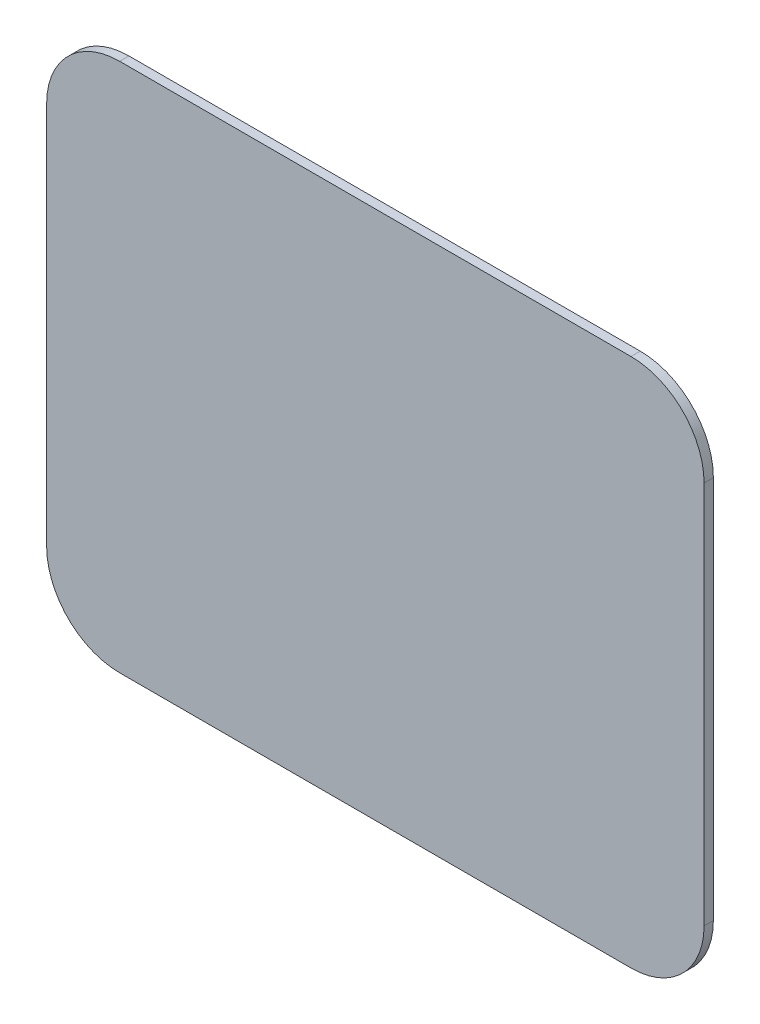
ISO-10303-21;
HEADER;
FILE_DESCRIPTION(('STEP AP214'),'2;1');
FILE_NAME('part.step','',(''),(''),'','','');
FILE_SCHEMA(('AUTOMOTIVE_DESIGN { 1 0 10303 214 1 1 1 1 }'));
ENDSEC;
DATA;
#1=APPLICATION_CONTEXT('core data for automotive mechanical design processes');
#2=APPLICATION_PROTOCOL_DEFINITION('international standard','automotive_design',2000,#1);
#3=PRODUCT_CONTEXT('',#1,'mechanical');
#4=PRODUCT('Part','Part','',(#3));
#5=PRODUCT_RELATED_PRODUCT_CATEGORY('part','',(#4));
#6=PRODUCT_DEFINITION_FORMATION('','',#4);
#7=PRODUCT_DEFINITION_CONTEXT('part definition',#1,'design');
#8=PRODUCT_DEFINITION('design','',#6,#7);
#9=PRODUCT_DEFINITION_SHAPE('','',#8);
#10=(LENGTH_UNIT() NAMED_UNIT(*) SI_UNIT(.MILLI.,.METRE.));
#11=(NAMED_UNIT(*) PLANE_ANGLE_UNIT() SI_UNIT($,.RADIAN.));
#12=(NAMED_UNIT(*) SI_UNIT($,.STERADIAN.) SOLID_ANGLE_UNIT());
#13=UNCERTAINTY_MEASURE_WITH_UNIT(LENGTH_MEASURE(1.E-05),#10,'distance_accuracy_value','');
#14=(GEOMETRIC_REPRESENTATION_CONTEXT(3) GLOBAL_UNCERTAINTY_ASSIGNED_CONTEXT((#13)) GLOBAL_UNIT_ASSIGNED_CONTEXT((#10,
#11,#12)) REPRESENTATION_CONTEXT('',''));
#15=CARTESIAN_POINT('',(0.,0.,0.));
#16=DIRECTION('',(0.,0.,1.));
#17=DIRECTION('',(1.,0.,0.));
#18=AXIS2_PLACEMENT_3D('',#15,#16,#17);
#19=CARTESIAN_POINT('',(-18.,14.5,0.508));
#20=DIRECTION('',(1.,0.,0.));
#21=DIRECTION('',(0.,1.,0.));
#22=AXIS2_PLACEMENT_3D('',#19,#20,#21);
#23=PLANE('',#22);
#24=DIRECTION('',(0.,-1.,0.));
#25=VECTOR('',#24,1.);
#26=CARTESIAN_POINT('',(-18.,14.5,0.));
#27=LINE('',#26,#25);
#28=CARTESIAN_POINT('',(-18.,10.5,0.));
#29=VERTEX_POINT('',#28);
#30=CARTESIAN_POINT('',(-18.,-10.5,0.));
#31=VERTEX_POINT('',#30);
#32=EDGE_CURVE('E131',#29,#31,#27,.T.);
#33=ORIENTED_EDGE('',*,*,#32,.T.);
#34=DIRECTION('',(0.,0.,-1.));
#35=VECTOR('',#34,1.);
#36=CARTESIAN_POINT('',(-18.,-10.5,0.508));
#37=LINE('',#36,#35);
#38=CARTESIAN_POINT('',(-18.,-10.5,0.508));
#39=VERTEX_POINT('',#38);
#40=EDGE_CURVE('E109',#31,#39,#37,.F.);
#41=ORIENTED_EDGE('',*,*,#40,.T.);
#42=DIRECTION('',(0.,-1.,0.));
#43=VECTOR('',#42,1.);
#44=CARTESIAN_POINT('',(-18.,14.5,0.508));
#45=LINE('',#44,#43);
#46=CARTESIAN_POINT('',(-18.,10.5,0.508));
#47=VERTEX_POINT('',#46);
#48=EDGE_CURVE('E140',#47,#39,#45,.T.);
#49=ORIENTED_EDGE('',*,*,#48,.F.);
#50=DIRECTION('',(0.,0.,-1.));
#51=VECTOR('',#50,1.);
#52=CARTESIAN_POINT('',(-18.,10.5,0.508));
#53=LINE('',#52,#51);
#54=EDGE_CURVE('E114',#47,#29,#53,.T.);
#55=ORIENTED_EDGE('',*,*,#54,.T.);
#56=EDGE_LOOP('',(#33,#41,#49,#55));
#57=FACE_BOUND('',#56,.T.);
#58=ADVANCED_FACE('F38',(#57),#23,.F.);
#59=CARTESIAN_POINT('',(-18.,-14.5,0.508));
#60=DIRECTION('',(0.,1.,0.));
#61=DIRECTION('',(0.,0.,1.));
#62=AXIS2_PLACEMENT_3D('',#59,#60,#61);
#63=PLANE('',#62);
#64=DIRECTION('',(1.,0.,0.));
#65=VECTOR('',#64,1.);
#66=CARTESIAN_POINT('',(-18.,-14.5,0.508));
#67=LINE('',#66,#65);
#68=CARTESIAN_POINT('',(-14.,-14.5,0.508));
#69=VERTEX_POINT('',#68);
#70=CARTESIAN_POINT('',(14.,-14.5,0.508));
#71=VERTEX_POINT('',#70);
#72=EDGE_CURVE('E124',#69,#71,#67,.T.);
#73=ORIENTED_EDGE('',*,*,#72,.F.);
#74=DIRECTION('',(0.,0.,-1.));
#75=VECTOR('',#74,1.);
#76=CARTESIAN_POINT('',(-14.,-14.5,0.508));
#77=LINE('',#76,#75);
#78=CARTESIAN_POINT('',(-14.,-14.5,0.));
#79=VERTEX_POINT('',#78);
#80=EDGE_CURVE('E108',#69,#79,#77,.T.);
#81=ORIENTED_EDGE('',*,*,#80,.T.);
#82=DIRECTION('',(1.,0.,0.));
#83=VECTOR('',#82,1.);
#84=CARTESIAN_POINT('',(-18.,-14.5,0.));
#85=LINE('',#84,#83);
#86=CARTESIAN_POINT('',(14.,-14.5,0.));
#87=VERTEX_POINT('',#86);
#88=EDGE_CURVE('E121',#79,#87,#85,.T.);
#89=ORIENTED_EDGE('',*,*,#88,.T.);
#90=DIRECTION('',(0.,0.,-1.));
#91=VECTOR('',#90,1.);
#92=CARTESIAN_POINT('',(14.,-14.5,0.508));
#93=LINE('',#92,#91);
#94=EDGE_CURVE('E126',#87,#71,#93,.F.);
#95=ORIENTED_EDGE('',*,*,#94,.T.);
#96=EDGE_LOOP('',(#73,#81,#89,#95));
#97=FACE_BOUND('',#96,.T.);
#98=ADVANCED_FACE('F120',(#97),#63,.F.);
#99=CARTESIAN_POINT('',(18.,14.5,0.508));
#100=DIRECTION('',(-1.,0.,0.));
#101=DIRECTION('',(0.,-1.,0.));
#102=AXIS2_PLACEMENT_3D('',#99,#100,#101);
#103=PLANE('',#102);
#104=DIRECTION('',(0.,1.,0.));
#105=VECTOR('',#104,1.);
#106=CARTESIAN_POINT('',(18.,14.5,0.508));
#107=LINE('',#106,#105);
#108=CARTESIAN_POINT('',(18.,-10.5,0.508));
#109=VERTEX_POINT('',#108);
#110=CARTESIAN_POINT('',(18.,10.5,0.508));
#111=VERTEX_POINT('',#110);
#112=EDGE_CURVE('E166',#109,#111,#107,.T.);
#113=ORIENTED_EDGE('',*,*,#112,.F.);
#114=DIRECTION('',(0.,0.,-1.));
#115=VECTOR('',#114,1.);
#116=CARTESIAN_POINT('',(18.,-10.5,0.508));
#117=LINE('',#116,#115);
#118=CARTESIAN_POINT('',(18.,-10.5,0.));
#119=VERTEX_POINT('',#118);
#120=EDGE_CURVE('E159',#109,#119,#117,.T.);
#121=ORIENTED_EDGE('',*,*,#120,.T.);
#122=DIRECTION('',(0.,1.,0.));
#123=VECTOR('',#122,1.);
#124=CARTESIAN_POINT('',(18.,14.5,0.));
#125=LINE('',#124,#123);
#126=CARTESIAN_POINT('',(18.,10.5,0.));
#127=VERTEX_POINT('',#126);
#128=EDGE_CURVE('E130',#119,#127,#125,.T.);
#129=ORIENTED_EDGE('',*,*,#128,.T.);
#130=DIRECTION('',(0.,0.,-1.));
#131=VECTOR('',#130,1.);
#132=CARTESIAN_POINT('',(18.,10.5,0.508));
#133=LINE('',#132,#131);
#134=EDGE_CURVE('E157',#127,#111,#133,.F.);
#135=ORIENTED_EDGE('',*,*,#134,.T.);
#136=EDGE_LOOP('',(#113,#121,#129,#135));
#137=FACE_BOUND('',#136,.T.);
#138=ADVANCED_FACE('F164',(#137),#103,.F.);
#139=CARTESIAN_POINT('',(-18.,14.5,0.508));
#140=DIRECTION('',(0.,-1.,0.));
#141=DIRECTION('',(0.,0.,-1.));
#142=AXIS2_PLACEMENT_3D('',#139,#140,#141);
#143=PLANE('',#142);
#144=DIRECTION('',(-1.,0.,0.));
#145=VECTOR('',#144,1.);
#146=CARTESIAN_POINT('',(-18.,14.5,0.508));
#147=LINE('',#146,#145);
#148=CARTESIAN_POINT('',(14.,14.5,0.508));
#149=VERTEX_POINT('',#148);
#150=CARTESIAN_POINT('',(-14.,14.5,0.508));
#151=VERTEX_POINT('',#150);
#152=EDGE_CURVE('E141',#149,#151,#147,.T.);
#153=ORIENTED_EDGE('',*,*,#152,.F.);
#154=DIRECTION('',(0.,0.,-1.));
#155=VECTOR('',#154,1.);
#156=CARTESIAN_POINT('',(14.,14.5,0.508));
#157=LINE('',#156,#155);
#158=CARTESIAN_POINT('',(14.,14.5,0.));
#159=VERTEX_POINT('',#158);
#160=EDGE_CURVE('E11',#149,#159,#157,.T.);
#161=ORIENTED_EDGE('',*,*,#160,.T.);
#162=DIRECTION('',(-1.,0.,0.));
#163=VECTOR('',#162,1.);
#164=CARTESIAN_POINT('',(-18.,14.5,0.));
#165=LINE('',#164,#163);
#166=CARTESIAN_POINT('',(-14.,14.5,0.));
#167=VERTEX_POINT('',#166);
#168=EDGE_CURVE('E134',#159,#167,#165,.T.);
#169=ORIENTED_EDGE('',*,*,#168,.T.);
#170=DIRECTION('',(0.,0.,-1.));
#171=VECTOR('',#170,1.);
#172=CARTESIAN_POINT('',(-14.,14.5,0.508));
#173=LINE('',#172,#171);
#174=EDGE_CURVE('E46',#167,#151,#173,.F.);
#175=ORIENTED_EDGE('',*,*,#174,.T.);
#176=EDGE_LOOP('',(#153,#161,#169,#175));
#177=FACE_BOUND('',#176,.T.);
#178=ADVANCED_FACE('F173',(#177),#143,.F.);
#179=CARTESIAN_POINT('',(-18.,-14.5,0.508));
#180=DIRECTION('',(0.,0.,1.));
#181=DIRECTION('',(1.,0.,0.));
#182=AXIS2_PLACEMENT_3D('',#179,#180,#181);
#183=PLANE('',#182);
#184=ORIENTED_EDGE('',*,*,#48,.T.);
#185=CARTESIAN_POINT('',(-14.,-10.5,0.508));
#186=DIRECTION('',(0.,0.,1.));
#187=DIRECTION('',(1.,0.,0.));
#188=AXIS2_PLACEMENT_3D('',#185,#186,#187);
#189=CIRCLE('',#188,4.);
#190=EDGE_CURVE('E155',#39,#69,#189,.T.);
#191=ORIENTED_EDGE('',*,*,#190,.T.);
#192=ORIENTED_EDGE('',*,*,#72,.T.);
#193=CARTESIAN_POINT('',(14.,-10.5,0.508));
#194=DIRECTION('',(0.,0.,1.));
#195=DIRECTION('',(1.,0.,0.));
#196=AXIS2_PLACEMENT_3D('',#193,#194,#195);
#197=CIRCLE('',#196,4.);
#198=EDGE_CURVE('E153',#71,#109,#197,.T.);
#199=ORIENTED_EDGE('',*,*,#198,.T.);
#200=ORIENTED_EDGE('',*,*,#112,.T.);
#201=CARTESIAN_POINT('',(14.,10.5,0.508));
#202=DIRECTION('',(0.,0.,1.));
#203=DIRECTION('',(1.,0.,0.));
#204=AXIS2_PLACEMENT_3D('',#201,#202,#203);
#205=CIRCLE('',#204,4.);
#206=EDGE_CURVE('E59',#111,#149,#205,.T.);
#207=ORIENTED_EDGE('',*,*,#206,.T.);
#208=ORIENTED_EDGE('',*,*,#152,.T.);
#209=CARTESIAN_POINT('',(-14.,10.5,0.508));
#210=DIRECTION('',(0.,0.,1.));
#211=DIRECTION('',(1.,0.,0.));
#212=AXIS2_PLACEMENT_3D('',#209,#210,#211);
#213=CIRCLE('',#212,4.);
#214=EDGE_CURVE('E150',#151,#47,#213,.T.);
#215=ORIENTED_EDGE('',*,*,#214,.T.);
#216=EDGE_LOOP('',(#184,#191,#192,#199,#200,#207,#208,#215));
#217=FACE_BOUND('',#216,.T.);
#218=ADVANCED_FACE('F180',(#217),#183,.T.);
#219=CARTESIAN_POINT('',(-18.,-14.5,0.));
#220=DIRECTION('',(0.,0.,1.));
#221=DIRECTION('',(1.,0.,0.));
#222=AXIS2_PLACEMENT_3D('',#219,#220,#221);
#223=PLANE('',#222);
#224=ORIENTED_EDGE('',*,*,#88,.F.);
#225=CARTESIAN_POINT('',(-14.,-10.5,0.));
#226=DIRECTION('',(0.,0.,1.));
#227=DIRECTION('',(1.,0.,0.));
#228=AXIS2_PLACEMENT_3D('',#225,#226,#227);
#229=CIRCLE('',#228,4.);
#230=EDGE_CURVE('E104',#79,#31,#229,.F.);
#231=ORIENTED_EDGE('',*,*,#230,.T.);
#232=ORIENTED_EDGE('',*,*,#32,.F.);
#233=CARTESIAN_POINT('',(-14.,10.5,0.));
#234=DIRECTION('',(0.,0.,1.));
#235=DIRECTION('',(1.,0.,0.));
#236=AXIS2_PLACEMENT_3D('',#233,#234,#235);
#237=CIRCLE('',#236,4.);
#238=EDGE_CURVE('E125',#29,#167,#237,.F.);
#239=ORIENTED_EDGE('',*,*,#238,.T.);
#240=ORIENTED_EDGE('',*,*,#168,.F.);
#241=CARTESIAN_POINT('',(14.,10.5,0.));
#242=DIRECTION('',(0.,0.,1.));
#243=DIRECTION('',(1.,0.,0.));
#244=AXIS2_PLACEMENT_3D('',#241,#242,#243);
#245=CIRCLE('',#244,4.);
#246=EDGE_CURVE('E144',#159,#127,#245,.F.);
#247=ORIENTED_EDGE('',*,*,#246,.T.);
#248=ORIENTED_EDGE('',*,*,#128,.F.);
#249=CARTESIAN_POINT('',(14.,-10.5,0.));
#250=DIRECTION('',(0.,0.,1.));
#251=DIRECTION('',(1.,0.,0.));
#252=AXIS2_PLACEMENT_3D('',#249,#250,#251);
#253=CIRCLE('',#252,4.);
#254=EDGE_CURVE('E115',#119,#87,#253,.F.);
#255=ORIENTED_EDGE('',*,*,#254,.T.);
#256=EDGE_LOOP('',(#224,#231,#232,#239,#240,#247,#248,#255));
#257=FACE_BOUND('',#256,.T.);
#258=ADVANCED_FACE('F128',(#257),#223,.F.);
#259=CARTESIAN_POINT('',(-14.,-10.5,0.508));
#260=DIRECTION('',(0.,0.,-1.));
#261=DIRECTION('',(-1.,0.,0.));
#262=AXIS2_PLACEMENT_3D('',#259,#260,#261);
#263=CYLINDRICAL_SURFACE('',#262,4.);
#264=ORIENTED_EDGE('',*,*,#190,.F.);
#265=ORIENTED_EDGE('',*,*,#40,.F.);
#266=ORIENTED_EDGE('',*,*,#230,.F.);
#267=ORIENTED_EDGE('',*,*,#80,.F.);
#268=EDGE_LOOP('',(#264,#265,#266,#267));
#269=FACE_BOUND('',#268,.T.);
#270=ADVANCED_FACE('F107',(#269),#263,.T.);
#271=CARTESIAN_POINT('',(14.,-10.5,0.508));
#272=DIRECTION('',(0.,0.,-1.));
#273=DIRECTION('',(-1.,0.,0.));
#274=AXIS2_PLACEMENT_3D('',#271,#272,#273);
#275=CYLINDRICAL_SURFACE('',#274,4.);
#276=ORIENTED_EDGE('',*,*,#198,.F.);
#277=ORIENTED_EDGE('',*,*,#94,.F.);
#278=ORIENTED_EDGE('',*,*,#254,.F.);
#279=ORIENTED_EDGE('',*,*,#120,.F.);
#280=EDGE_LOOP('',(#276,#277,#278,#279));
#281=FACE_BOUND('',#280,.T.);
#282=ADVANCED_FACE('F188',(#281),#275,.T.);
#283=CARTESIAN_POINT('',(14.,10.5,0.508));
#284=DIRECTION('',(0.,0.,-1.));
#285=DIRECTION('',(-1.,0.,0.));
#286=AXIS2_PLACEMENT_3D('',#283,#284,#285);
#287=CYLINDRICAL_SURFACE('',#286,4.);
#288=ORIENTED_EDGE('',*,*,#206,.F.);
#289=ORIENTED_EDGE('',*,*,#134,.F.);
#290=ORIENTED_EDGE('',*,*,#246,.F.);
#291=ORIENTED_EDGE('',*,*,#160,.F.);
#292=EDGE_LOOP('',(#288,#289,#290,#291));
#293=FACE_BOUND('',#292,.T.);
#294=ADVANCED_FACE('F172',(#293),#287,.T.);
#295=CARTESIAN_POINT('',(-14.,10.5,0.508));
#296=DIRECTION('',(0.,0.,-1.));
#297=DIRECTION('',(-1.,0.,0.));
#298=AXIS2_PLACEMENT_3D('',#295,#296,#297);
#299=CYLINDRICAL_SURFACE('',#298,4.);
#300=ORIENTED_EDGE('',*,*,#214,.F.);
#301=ORIENTED_EDGE('',*,*,#174,.F.);
#302=ORIENTED_EDGE('',*,*,#238,.F.);
#303=ORIENTED_EDGE('',*,*,#54,.F.);
#304=EDGE_LOOP('',(#300,#301,#302,#303));
#305=FACE_BOUND('',#304,.T.);
#306=ADVANCED_FACE('F40',(#305),#299,.T.);
#307=CLOSED_SHELL('',(#58,#98,#138,#178,#218,#258,#270,#282,#294,#306));
#308=MANIFOLD_SOLID_BREP('B2',#307);
#309=ADVANCED_BREP_SHAPE_REPRESENTATION('',(#18,#308),#14);
#310=SHAPE_DEFINITION_REPRESENTATION(#9,#309);
ENDSEC;
END-ISO-10303-21;
